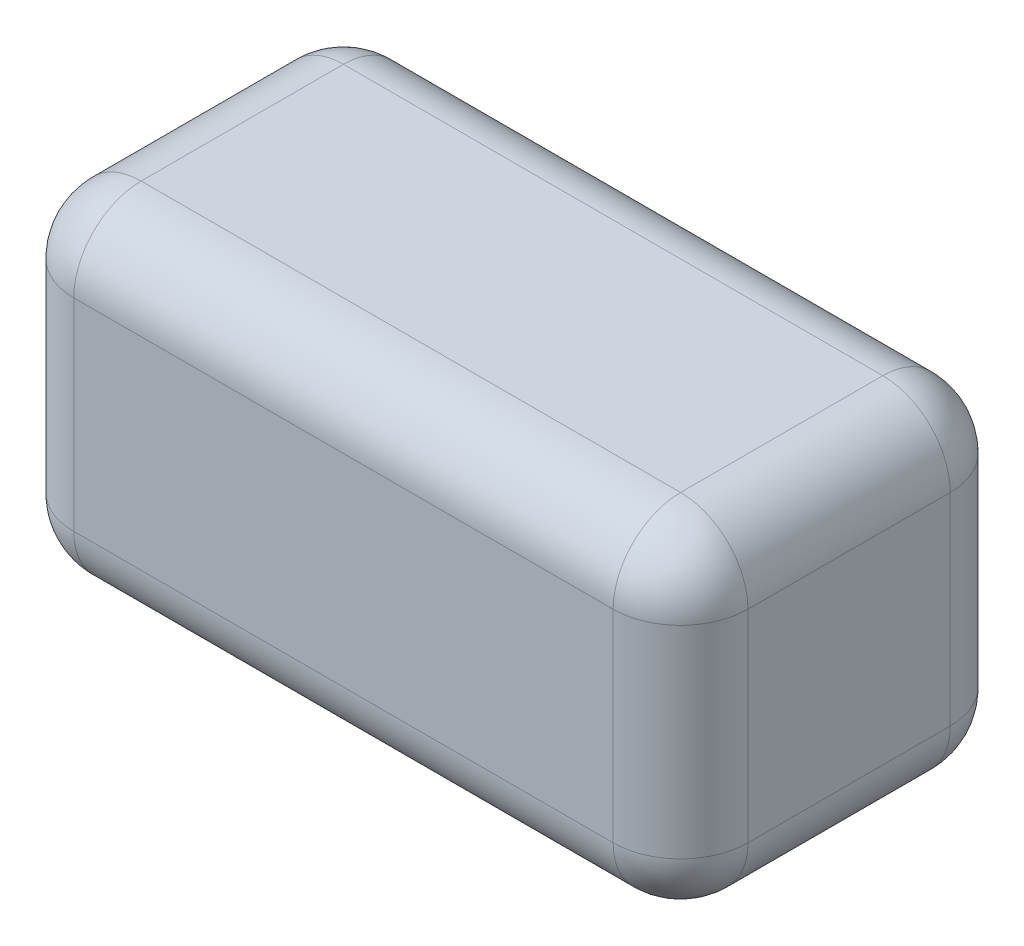
ISO-10303-21;
HEADER;
FILE_DESCRIPTION(('STEP AP214'),'2;1');
FILE_NAME('part.step','',(''),(''),'','','');
FILE_SCHEMA(('AUTOMOTIVE_DESIGN { 1 0 10303 214 1 1 1 1 }'));
ENDSEC;
DATA;
#1=APPLICATION_CONTEXT('core data for automotive mechanical design processes');
#2=APPLICATION_PROTOCOL_DEFINITION('international standard','automotive_design',2000,#1);
#3=PRODUCT_CONTEXT('',#1,'mechanical');
#4=PRODUCT('Part','Part','',(#3));
#5=PRODUCT_RELATED_PRODUCT_CATEGORY('part','',(#4));
#6=PRODUCT_DEFINITION_FORMATION('','',#4);
#7=PRODUCT_DEFINITION_CONTEXT('part definition',#1,'design');
#8=PRODUCT_DEFINITION('design','',#6,#7);
#9=PRODUCT_DEFINITION_SHAPE('','',#8);
#10=(LENGTH_UNIT() NAMED_UNIT(*) SI_UNIT(.MILLI.,.METRE.));
#11=(NAMED_UNIT(*) PLANE_ANGLE_UNIT() SI_UNIT($,.RADIAN.));
#12=(NAMED_UNIT(*) SI_UNIT($,.STERADIAN.) SOLID_ANGLE_UNIT());
#13=UNCERTAINTY_MEASURE_WITH_UNIT(LENGTH_MEASURE(1.E-05),#10,'distance_accuracy_value','');
#14=(GEOMETRIC_REPRESENTATION_CONTEXT(3) GLOBAL_UNCERTAINTY_ASSIGNED_CONTEXT((#13)) GLOBAL_UNIT_ASSIGNED_CONTEXT((#10,
#11,#12)) REPRESENTATION_CONTEXT('',''));
#15=CARTESIAN_POINT('',(0.,0.,0.));
#16=DIRECTION('',(0.,0.,1.));
#17=DIRECTION('',(1.,0.,0.));
#18=AXIS2_PLACEMENT_3D('',#15,#16,#17);
#19=CARTESIAN_POINT('',(-50.,50.,-25.));
#20=DIRECTION('',(1.,0.,0.));
#21=DIRECTION('',(0.,0.,-1.));
#22=AXIS2_PLACEMENT_3D('',#19,#20,#21);
#23=PLANE('',#22);
#24=DIRECTION('',(0.,0.,1.));
#25=VECTOR('',#24,1.);
#26=CARTESIAN_POINT('',(-50.,40.,-25.));
#27=LINE('',#26,#25);
#28=CARTESIAN_POINT('',(-50.,40.,15.));
#29=VERTEX_POINT('',#28);
#30=CARTESIAN_POINT('',(-50.,40.,-15.));
#31=VERTEX_POINT('',#30);
#32=EDGE_CURVE('E203',#29,#31,#27,.F.);
#33=ORIENTED_EDGE('',*,*,#32,.T.);
#34=DIRECTION('',(0.,-1.,0.));
#35=VECTOR('',#34,1.);
#36=CARTESIAN_POINT('',(-50.,50.,-15.));
#37=LINE('',#36,#35);
#38=CARTESIAN_POINT('',(-50.,10.,-15.));
#39=VERTEX_POINT('',#38);
#40=EDGE_CURVE('E276',#31,#39,#37,.T.);
#41=ORIENTED_EDGE('',*,*,#40,.T.);
#42=DIRECTION('',(0.,0.,1.));
#43=VECTOR('',#42,1.);
#44=CARTESIAN_POINT('',(-50.,10.,15.));
#45=LINE('',#44,#43);
#46=CARTESIAN_POINT('',(-50.,10.,15.));
#47=VERTEX_POINT('',#46);
#48=EDGE_CURVE('E273',#39,#47,#45,.T.);
#49=ORIENTED_EDGE('',*,*,#48,.T.);
#50=DIRECTION('',(0.,-1.,0.));
#51=VECTOR('',#50,1.);
#52=CARTESIAN_POINT('',(-50.,50.,15.));
#53=LINE('',#52,#51);
#54=EDGE_CURVE('E200',#47,#29,#53,.F.);
#55=ORIENTED_EDGE('',*,*,#54,.T.);
#56=EDGE_LOOP('',(#33,#41,#49,#55));
#57=FACE_BOUND('',#56,.T.);
#58=ADVANCED_FACE('F40',(#57),#23,.F.);
#59=CARTESIAN_POINT('',(50.,50.,25.));
#60=DIRECTION('',(0.,0.,-1.));
#61=DIRECTION('',(-1.,0.,0.));
#62=AXIS2_PLACEMENT_3D('',#59,#60,#61);
#63=PLANE('',#62);
#64=DIRECTION('',(1.,0.,0.));
#65=VECTOR('',#64,1.);
#66=CARTESIAN_POINT('',(50.,40.,25.));
#67=LINE('',#66,#65);
#68=CARTESIAN_POINT('',(40.,40.,25.));
#69=VERTEX_POINT('',#68);
#70=CARTESIAN_POINT('',(-40.,40.,25.));
#71=VERTEX_POINT('',#70);
#72=EDGE_CURVE('E213',#69,#71,#67,.F.);
#73=ORIENTED_EDGE('',*,*,#72,.T.);
#74=DIRECTION('',(0.,-1.,0.));
#75=VECTOR('',#74,1.);
#76=CARTESIAN_POINT('',(-40.,50.,25.));
#77=LINE('',#76,#75);
#78=CARTESIAN_POINT('',(-40.,10.,25.));
#79=VERTEX_POINT('',#78);
#80=EDGE_CURVE('E216',#71,#79,#77,.T.);
#81=ORIENTED_EDGE('',*,*,#80,.T.);
#82=DIRECTION('',(1.,0.,0.));
#83=VECTOR('',#82,1.);
#84=CARTESIAN_POINT('',(50.,10.,25.));
#85=LINE('',#84,#83);
#86=CARTESIAN_POINT('',(40.,10.,25.));
#87=VERTEX_POINT('',#86);
#88=EDGE_CURVE('E207',#79,#87,#85,.T.);
#89=ORIENTED_EDGE('',*,*,#88,.T.);
#90=DIRECTION('',(0.,-1.,0.));
#91=VECTOR('',#90,1.);
#92=CARTESIAN_POINT('',(40.,50.,25.));
#93=LINE('',#92,#91);
#94=EDGE_CURVE('E210',#87,#69,#93,.F.);
#95=ORIENTED_EDGE('',*,*,#94,.T.);
#96=EDGE_LOOP('',(#73,#81,#89,#95));
#97=FACE_BOUND('',#96,.T.);
#98=ADVANCED_FACE('F371',(#97),#63,.F.);
#99=CARTESIAN_POINT('',(50.,50.,-25.));
#100=DIRECTION('',(-1.,0.,0.));
#101=DIRECTION('',(0.,0.,1.));
#102=AXIS2_PLACEMENT_3D('',#99,#100,#101);
#103=PLANE('',#102);
#104=DIRECTION('',(0.,0.,-1.));
#105=VECTOR('',#104,1.);
#106=CARTESIAN_POINT('',(50.,10.,-25.));
#107=LINE('',#106,#105);
#108=CARTESIAN_POINT('',(50.,10.,15.));
#109=VERTEX_POINT('',#108);
#110=CARTESIAN_POINT('',(50.,10.,-15.));
#111=VERTEX_POINT('',#110);
#112=EDGE_CURVE('E175',#109,#111,#107,.T.);
#113=ORIENTED_EDGE('',*,*,#112,.T.);
#114=DIRECTION('',(0.,-1.,0.));
#115=VECTOR('',#114,1.);
#116=CARTESIAN_POINT('',(50.,50.,-15.));
#117=LINE('',#116,#115);
#118=CARTESIAN_POINT('',(50.,40.,-15.));
#119=VERTEX_POINT('',#118);
#120=EDGE_CURVE('E179',#111,#119,#117,.F.);
#121=ORIENTED_EDGE('',*,*,#120,.T.);
#122=DIRECTION('',(0.,0.,-1.));
#123=VECTOR('',#122,1.);
#124=CARTESIAN_POINT('',(50.,40.,-25.));
#125=LINE('',#124,#123);
#126=CARTESIAN_POINT('',(50.,40.,15.));
#127=VERTEX_POINT('',#126);
#128=EDGE_CURVE('E170',#119,#127,#125,.F.);
#129=ORIENTED_EDGE('',*,*,#128,.T.);
#130=DIRECTION('',(0.,-1.,0.));
#131=VECTOR('',#130,1.);
#132=CARTESIAN_POINT('',(50.,50.,15.));
#133=LINE('',#132,#131);
#134=EDGE_CURVE('E167',#127,#109,#133,.T.);
#135=ORIENTED_EDGE('',*,*,#134,.T.);
#136=EDGE_LOOP('',(#113,#121,#129,#135));
#137=FACE_BOUND('',#136,.T.);
#138=ADVANCED_FACE('F329',(#137),#103,.F.);
#139=CARTESIAN_POINT('',(50.,50.,-25.));
#140=DIRECTION('',(0.,0.,1.));
#141=DIRECTION('',(1.,0.,0.));
#142=AXIS2_PLACEMENT_3D('',#139,#140,#141);
#143=PLANE('',#142);
#144=DIRECTION('',(-1.,0.,0.));
#145=VECTOR('',#144,1.);
#146=CARTESIAN_POINT('',(-50.,10.,-25.));
#147=LINE('',#146,#145);
#148=CARTESIAN_POINT('',(40.,10.,-25.));
#149=VERTEX_POINT('',#148);
#150=CARTESIAN_POINT('',(-40.,10.,-25.));
#151=VERTEX_POINT('',#150);
#152=EDGE_CURVE('E64',#149,#151,#147,.T.);
#153=ORIENTED_EDGE('',*,*,#152,.T.);
#154=DIRECTION('',(0.,-1.,0.));
#155=VECTOR('',#154,1.);
#156=CARTESIAN_POINT('',(-40.,50.,-25.));
#157=LINE('',#156,#155);
#158=CARTESIAN_POINT('',(-40.,40.,-25.));
#159=VERTEX_POINT('',#158);
#160=EDGE_CURVE('E135',#151,#159,#157,.F.);
#161=ORIENTED_EDGE('',*,*,#160,.T.);
#162=DIRECTION('',(-1.,0.,0.));
#163=VECTOR('',#162,1.);
#164=CARTESIAN_POINT('',(50.,40.,-25.));
#165=LINE('',#164,#163);
#166=CARTESIAN_POINT('',(40.,40.,-25.));
#167=VERTEX_POINT('',#166);
#168=EDGE_CURVE('E130',#159,#167,#165,.F.);
#169=ORIENTED_EDGE('',*,*,#168,.T.);
#170=DIRECTION('',(0.,-1.,0.));
#171=VECTOR('',#170,1.);
#172=CARTESIAN_POINT('',(40.,50.,-25.));
#173=LINE('',#172,#171);
#174=EDGE_CURVE('E134',#167,#149,#173,.T.);
#175=ORIENTED_EDGE('',*,*,#174,.T.);
#176=EDGE_LOOP('',(#153,#161,#169,#175));
#177=FACE_BOUND('',#176,.T.);
#178=ADVANCED_FACE('F132',(#177),#143,.F.);
#179=CARTESIAN_POINT('',(0.,50.,0.));
#180=DIRECTION('',(0.,-1.,0.));
#181=DIRECTION('',(0.,0.,-1.));
#182=AXIS2_PLACEMENT_3D('',#179,#180,#181);
#183=PLANE('',#182);
#184=DIRECTION('',(0.,0.,-1.));
#185=VECTOR('',#184,1.);
#186=CARTESIAN_POINT('',(40.,50.,0.));
#187=LINE('',#186,#185);
#188=CARTESIAN_POINT('',(40.,50.,15.));
#189=VERTEX_POINT('',#188);
#190=CARTESIAN_POINT('',(40.,50.,-15.));
#191=VERTEX_POINT('',#190);
#192=EDGE_CURVE('E195',#189,#191,#187,.T.);
#193=ORIENTED_EDGE('',*,*,#192,.T.);
#194=DIRECTION('',(-1.,0.,0.));
#195=VECTOR('',#194,1.);
#196=CARTESIAN_POINT('',(0.,50.,-15.));
#197=LINE('',#196,#195);
#198=CARTESIAN_POINT('',(-40.,50.,-15.));
#199=VERTEX_POINT('',#198);
#200=EDGE_CURVE('E147',#191,#199,#197,.T.);
#201=ORIENTED_EDGE('',*,*,#200,.T.);
#202=DIRECTION('',(0.,0.,1.));
#203=VECTOR('',#202,1.);
#204=CARTESIAN_POINT('',(-40.,50.,0.));
#205=LINE('',#204,#203);
#206=CARTESIAN_POINT('',(-40.,50.,15.));
#207=VERTEX_POINT('',#206);
#208=EDGE_CURVE('E192',#199,#207,#205,.T.);
#209=ORIENTED_EDGE('',*,*,#208,.T.);
#210=DIRECTION('',(1.,0.,0.));
#211=VECTOR('',#210,1.);
#212=CARTESIAN_POINT('',(0.,50.,15.));
#213=LINE('',#212,#211);
#214=EDGE_CURVE('E189',#207,#189,#213,.T.);
#215=ORIENTED_EDGE('',*,*,#214,.T.);
#216=EDGE_LOOP('',(#193,#201,#209,#215));
#217=FACE_BOUND('',#216,.T.);
#218=ADVANCED_FACE('F321',(#217),#183,.F.);
#219=CARTESIAN_POINT('',(0.,0.,0.));
#220=DIRECTION('',(0.,-1.,0.));
#221=DIRECTION('',(0.,0.,-1.));
#222=AXIS2_PLACEMENT_3D('',#219,#220,#221);
#223=PLANE('',#222);
#224=DIRECTION('',(1.,0.,0.));
#225=VECTOR('',#224,1.);
#226=CARTESIAN_POINT('',(-50.,0.,15.));
#227=LINE('',#226,#225);
#228=CARTESIAN_POINT('',(40.,0.,15.));
#229=VERTEX_POINT('',#228);
#230=CARTESIAN_POINT('',(-40.,0.,15.));
#231=VERTEX_POINT('',#230);
#232=EDGE_CURVE('E183',#229,#231,#227,.F.);
#233=ORIENTED_EDGE('',*,*,#232,.T.);
#234=DIRECTION('',(0.,0.,1.));
#235=VECTOR('',#234,1.);
#236=CARTESIAN_POINT('',(-40.,0.,-25.));
#237=LINE('',#236,#235);
#238=CARTESIAN_POINT('',(-40.,0.,-15.));
#239=VERTEX_POINT('',#238);
#240=EDGE_CURVE('E11',#231,#239,#237,.F.);
#241=ORIENTED_EDGE('',*,*,#240,.T.);
#242=DIRECTION('',(-1.,0.,0.));
#243=VECTOR('',#242,1.);
#244=CARTESIAN_POINT('',(40.,0.,-15.));
#245=LINE('',#244,#243);
#246=CARTESIAN_POINT('',(40.,0.,-15.));
#247=VERTEX_POINT('',#246);
#248=EDGE_CURVE('E50',#239,#247,#245,.F.);
#249=ORIENTED_EDGE('',*,*,#248,.T.);
#250=DIRECTION('',(0.,0.,-1.));
#251=VECTOR('',#250,1.);
#252=CARTESIAN_POINT('',(40.,0.,25.));
#253=LINE('',#252,#251);
#254=EDGE_CURVE('E186',#247,#229,#253,.F.);
#255=ORIENTED_EDGE('',*,*,#254,.T.);
#256=EDGE_LOOP('',(#233,#241,#249,#255));
#257=FACE_BOUND('',#256,.T.);
#258=ADVANCED_FACE('F357',(#257),#223,.T.);
#259=CARTESIAN_POINT('',(0.,40.,15.));
#260=DIRECTION('',(1.,0.,0.));
#261=DIRECTION('',(0.,0.,-1.));
#262=AXIS2_PLACEMENT_3D('',#259,#260,#261);
#263=CYLINDRICAL_SURFACE('',#262,10.);
#264=CARTESIAN_POINT('',(-40.,40.,15.));
#265=DIRECTION('',(-1.,0.,0.));
#266=DIRECTION('',(0.,0.,1.));
#267=AXIS2_PLACEMENT_3D('',#264,#265,#266);
#268=CIRCLE('',#267,10.);
#269=EDGE_CURVE('E139',#71,#207,#268,.T.);
#270=ORIENTED_EDGE('',*,*,#269,.F.);
#271=ORIENTED_EDGE('',*,*,#72,.F.);
#272=CARTESIAN_POINT('',(40.,40.,15.));
#273=DIRECTION('',(1.,0.,0.));
#274=DIRECTION('',(0.,0.,-1.));
#275=AXIS2_PLACEMENT_3D('',#272,#273,#274);
#276=CIRCLE('',#275,10.);
#277=EDGE_CURVE('E245',#189,#69,#276,.T.);
#278=ORIENTED_EDGE('',*,*,#277,.F.);
#279=ORIENTED_EDGE('',*,*,#214,.F.);
#280=EDGE_LOOP('',(#270,#271,#278,#279));
#281=FACE_BOUND('',#280,.T.);
#282=ADVANCED_FACE('F374',(#281),#263,.T.);
#283=CARTESIAN_POINT('',(-40.,40.,15.));
#284=DIRECTION('',(0.,0.,1.));
#285=DIRECTION('',(1.,0.,0.));
#286=AXIS2_PLACEMENT_3D('',#283,#284,#285);
#287=SPHERICAL_SURFACE('',#286,10.);
#288=CARTESIAN_POINT('',(-40.,40.,15.));
#289=DIRECTION('',(0.,0.,1.));
#290=DIRECTION('',(1.,0.,0.));
#291=AXIS2_PLACEMENT_3D('',#288,#289,#290);
#292=CIRCLE('',#291,10.);
#293=EDGE_CURVE('E241',#29,#207,#292,.F.);
#294=ORIENTED_EDGE('',*,*,#293,.F.);
#295=CARTESIAN_POINT('',(-40.,40.,15.));
#296=DIRECTION('',(0.,1.,0.));
#297=DIRECTION('',(0.,0.,1.));
#298=AXIS2_PLACEMENT_3D('',#295,#296,#297);
#299=CIRCLE('',#298,10.);
#300=EDGE_CURVE('E249',#71,#29,#299,.F.);
#301=ORIENTED_EDGE('',*,*,#300,.F.);
#302=ORIENTED_EDGE('',*,*,#269,.T.);
#303=EDGE_LOOP('',(#294,#301,#302));
#304=FACE_BOUND('',#303,.T.);
#305=ADVANCED_FACE('F384',(#304),#287,.T.);
#306=CARTESIAN_POINT('',(-40.,50.,15.));
#307=DIRECTION('',(0.,-1.,0.));
#308=DIRECTION('',(0.,0.,-1.));
#309=AXIS2_PLACEMENT_3D('',#306,#307,#308);
#310=CYLINDRICAL_SURFACE('',#309,10.);
#311=ORIENTED_EDGE('',*,*,#54,.F.);
#312=CARTESIAN_POINT('',(-40.,10.,15.));
#313=DIRECTION('',(0.,-1.,0.));
#314=DIRECTION('',(0.,0.,-1.));
#315=AXIS2_PLACEMENT_3D('',#312,#313,#314);
#316=CIRCLE('',#315,10.);
#317=EDGE_CURVE('E264',#47,#79,#316,.F.);
#318=ORIENTED_EDGE('',*,*,#317,.T.);
#319=ORIENTED_EDGE('',*,*,#80,.F.);
#320=ORIENTED_EDGE('',*,*,#300,.T.);
#321=EDGE_LOOP('',(#311,#318,#319,#320));
#322=FACE_BOUND('',#321,.T.);
#323=ADVANCED_FACE('F346',(#322),#310,.T.);
#324=CARTESIAN_POINT('',(40.,40.,15.));
#325=DIRECTION('',(0.,0.,1.));
#326=DIRECTION('',(1.,0.,0.));
#327=AXIS2_PLACEMENT_3D('',#324,#325,#326);
#328=SPHERICAL_SURFACE('',#327,10.);
#329=CARTESIAN_POINT('',(40.,40.,15.));
#330=DIRECTION('',(0.,0.,1.));
#331=DIRECTION('',(0.,-1.,0.));
#332=AXIS2_PLACEMENT_3D('',#329,#330,#331);
#333=CIRCLE('',#332,10.);
#334=EDGE_CURVE('E233',#189,#127,#333,.F.);
#335=ORIENTED_EDGE('',*,*,#334,.F.);
#336=ORIENTED_EDGE('',*,*,#277,.T.);
#337=CARTESIAN_POINT('',(40.,40.,15.));
#338=DIRECTION('',(0.,1.,0.));
#339=DIRECTION('',(0.,0.,1.));
#340=AXIS2_PLACEMENT_3D('',#337,#338,#339);
#341=CIRCLE('',#340,10.);
#342=EDGE_CURVE('E237',#127,#69,#341,.F.);
#343=ORIENTED_EDGE('',*,*,#342,.F.);
#344=EDGE_LOOP('',(#335,#336,#343));
#345=FACE_BOUND('',#344,.T.);
#346=ADVANCED_FACE('F376',(#345),#328,.T.);
#347=CARTESIAN_POINT('',(-40.,40.,0.));
#348=DIRECTION('',(0.,0.,1.));
#349=DIRECTION('',(1.,0.,0.));
#350=AXIS2_PLACEMENT_3D('',#347,#348,#349);
#351=CYLINDRICAL_SURFACE('',#350,10.);
#352=ORIENTED_EDGE('',*,*,#208,.F.);
#353=CARTESIAN_POINT('',(-40.,40.,-15.));
#354=DIRECTION('',(0.,0.,1.));
#355=DIRECTION('',(1.,0.,0.));
#356=AXIS2_PLACEMENT_3D('',#353,#354,#355);
#357=CIRCLE('',#356,10.);
#358=EDGE_CURVE('E270',#199,#31,#357,.T.);
#359=ORIENTED_EDGE('',*,*,#358,.T.);
#360=ORIENTED_EDGE('',*,*,#32,.F.);
#361=ORIENTED_EDGE('',*,*,#293,.T.);
#362=EDGE_LOOP('',(#352,#359,#360,#361));
#363=FACE_BOUND('',#362,.T.);
#364=ADVANCED_FACE('F316',(#363),#351,.T.);
#365=CARTESIAN_POINT('',(50.,10.,15.));
#366=DIRECTION('',(-1.,0.,0.));
#367=DIRECTION('',(0.,0.,1.));
#368=AXIS2_PLACEMENT_3D('',#365,#366,#367);
#369=CYLINDRICAL_SURFACE('',#368,10.);
#370=ORIENTED_EDGE('',*,*,#88,.F.);
#371=CARTESIAN_POINT('',(-40.,10.,15.));
#372=DIRECTION('',(-1.,0.,0.));
#373=DIRECTION('',(0.,0.,1.));
#374=AXIS2_PLACEMENT_3D('',#371,#372,#373);
#375=CIRCLE('',#374,10.);
#376=EDGE_CURVE('E261',#79,#231,#375,.F.);
#377=ORIENTED_EDGE('',*,*,#376,.T.);
#378=ORIENTED_EDGE('',*,*,#232,.F.);
#379=CARTESIAN_POINT('',(40.,10.,15.));
#380=DIRECTION('',(1.,0.,0.));
#381=DIRECTION('',(0.,0.,-1.));
#382=AXIS2_PLACEMENT_3D('',#379,#380,#381);
#383=CIRCLE('',#382,10.);
#384=EDGE_CURVE('E229',#87,#229,#383,.T.);
#385=ORIENTED_EDGE('',*,*,#384,.F.);
#386=EDGE_LOOP('',(#370,#377,#378,#385));
#387=FACE_BOUND('',#386,.T.);
#388=ADVANCED_FACE('F355',(#387),#369,.T.);
#389=CARTESIAN_POINT('',(40.,50.,15.));
#390=DIRECTION('',(0.,-1.,0.));
#391=DIRECTION('',(0.,0.,-1.));
#392=AXIS2_PLACEMENT_3D('',#389,#390,#391);
#393=CYLINDRICAL_SURFACE('',#392,10.);
#394=ORIENTED_EDGE('',*,*,#342,.T.);
#395=ORIENTED_EDGE('',*,*,#94,.F.);
#396=CARTESIAN_POINT('',(40.,10.,15.));
#397=DIRECTION('',(0.,-1.,0.));
#398=DIRECTION('',(0.,0.,-1.));
#399=AXIS2_PLACEMENT_3D('',#396,#397,#398);
#400=CIRCLE('',#399,10.);
#401=EDGE_CURVE('E225',#109,#87,#400,.T.);
#402=ORIENTED_EDGE('',*,*,#401,.F.);
#403=ORIENTED_EDGE('',*,*,#134,.F.);
#404=EDGE_LOOP('',(#394,#395,#402,#403));
#405=FACE_BOUND('',#404,.T.);
#406=ADVANCED_FACE('F368',(#405),#393,.T.);
#407=CARTESIAN_POINT('',(40.,40.,0.));
#408=DIRECTION('',(0.,0.,-1.));
#409=DIRECTION('',(-1.,0.,0.));
#410=AXIS2_PLACEMENT_3D('',#407,#408,#409);
#411=CYLINDRICAL_SURFACE('',#410,10.);
#412=ORIENTED_EDGE('',*,*,#334,.T.);
#413=ORIENTED_EDGE('',*,*,#128,.F.);
#414=CARTESIAN_POINT('',(40.,40.,-15.));
#415=DIRECTION('',(0.,0.,-1.));
#416=DIRECTION('',(-1.,0.,0.));
#417=AXIS2_PLACEMENT_3D('',#414,#415,#416);
#418=CIRCLE('',#417,10.);
#419=EDGE_CURVE('E152',#191,#119,#418,.T.);
#420=ORIENTED_EDGE('',*,*,#419,.F.);
#421=ORIENTED_EDGE('',*,*,#192,.F.);
#422=EDGE_LOOP('',(#412,#413,#420,#421));
#423=FACE_BOUND('',#422,.T.);
#424=ADVANCED_FACE('F325',(#423),#411,.T.);
#425=CARTESIAN_POINT('',(0.,40.,-15.));
#426=DIRECTION('',(-1.,0.,0.));
#427=DIRECTION('',(0.,0.,1.));
#428=AXIS2_PLACEMENT_3D('',#425,#426,#427);
#429=CYLINDRICAL_SURFACE('',#428,10.);
#430=ORIENTED_EDGE('',*,*,#168,.F.);
#431=CARTESIAN_POINT('',(-40.,40.,-15.));
#432=DIRECTION('',(-1.,0.,0.));
#433=DIRECTION('',(0.,0.,1.));
#434=AXIS2_PLACEMENT_3D('',#431,#432,#433);
#435=CIRCLE('',#434,10.);
#436=EDGE_CURVE('E267',#159,#199,#435,.F.);
#437=ORIENTED_EDGE('',*,*,#436,.T.);
#438=ORIENTED_EDGE('',*,*,#200,.F.);
#439=CARTESIAN_POINT('',(40.,40.,-15.));
#440=DIRECTION('',(1.,0.,0.));
#441=DIRECTION('',(0.,0.,-1.));
#442=AXIS2_PLACEMENT_3D('',#439,#440,#441);
#443=CIRCLE('',#442,10.);
#444=EDGE_CURVE('E143',#167,#191,#443,.T.);
#445=ORIENTED_EDGE('',*,*,#444,.F.);
#446=EDGE_LOOP('',(#430,#437,#438,#445));
#447=FACE_BOUND('',#446,.T.);
#448=ADVANCED_FACE('F145',(#447),#429,.T.);
#449=CARTESIAN_POINT('',(40.,10.,15.));
#450=DIRECTION('',(0.,0.,1.));
#451=DIRECTION('',(0.,-1.,0.));
#452=AXIS2_PLACEMENT_3D('',#449,#450,#451);
#453=SPHERICAL_SURFACE('',#452,10.);
#454=ORIENTED_EDGE('',*,*,#401,.T.);
#455=ORIENTED_EDGE('',*,*,#384,.T.);
#456=CARTESIAN_POINT('',(40.,10.,15.));
#457=DIRECTION('',(0.,0.,1.));
#458=DIRECTION('',(1.,0.,0.));
#459=AXIS2_PLACEMENT_3D('',#456,#457,#458);
#460=CIRCLE('',#459,10.);
#461=EDGE_CURVE('E153',#109,#229,#460,.F.);
#462=ORIENTED_EDGE('',*,*,#461,.F.);
#463=EDGE_LOOP('',(#454,#455,#462));
#464=FACE_BOUND('',#463,.T.);
#465=ADVANCED_FACE('F363',(#464),#453,.T.);
#466=CARTESIAN_POINT('',(40.,40.,-15.));
#467=DIRECTION('',(0.,1.,0.));
#468=DIRECTION('',(0.,0.,1.));
#469=AXIS2_PLACEMENT_3D('',#466,#467,#468);
#470=SPHERICAL_SURFACE('',#469,10.);
#471=ORIENTED_EDGE('',*,*,#444,.T.);
#472=ORIENTED_EDGE('',*,*,#419,.T.);
#473=CARTESIAN_POINT('',(40.,40.,-15.));
#474=DIRECTION('',(0.,1.,0.));
#475=DIRECTION('',(0.,0.,1.));
#476=AXIS2_PLACEMENT_3D('',#473,#474,#475);
#477=CIRCLE('',#476,10.);
#478=EDGE_CURVE('E155',#167,#119,#477,.F.);
#479=ORIENTED_EDGE('',*,*,#478,.F.);
#480=EDGE_LOOP('',(#471,#472,#479));
#481=FACE_BOUND('',#480,.T.);
#482=ADVANCED_FACE('F156',(#481),#470,.T.);
#483=CARTESIAN_POINT('',(40.,10.,-25.));
#484=DIRECTION('',(0.,0.,1.));
#485=DIRECTION('',(1.,0.,0.));
#486=AXIS2_PLACEMENT_3D('',#483,#484,#485);
#487=CYLINDRICAL_SURFACE('',#486,10.);
#488=ORIENTED_EDGE('',*,*,#254,.F.);
#489=CARTESIAN_POINT('',(40.,10.,-15.));
#490=DIRECTION('',(0.,0.,1.));
#491=DIRECTION('',(1.,0.,0.));
#492=AXIS2_PLACEMENT_3D('',#489,#490,#491);
#493=CIRCLE('',#492,10.);
#494=EDGE_CURVE('E258',#247,#111,#493,.T.);
#495=ORIENTED_EDGE('',*,*,#494,.T.);
#496=ORIENTED_EDGE('',*,*,#112,.F.);
#497=ORIENTED_EDGE('',*,*,#461,.T.);
#498=EDGE_LOOP('',(#488,#495,#496,#497));
#499=FACE_BOUND('',#498,.T.);
#500=ADVANCED_FACE('F360',(#499),#487,.T.);
#501=CARTESIAN_POINT('',(40.,50.,-15.));
#502=DIRECTION('',(0.,-1.,0.));
#503=DIRECTION('',(0.,0.,-1.));
#504=AXIS2_PLACEMENT_3D('',#501,#502,#503);
#505=CYLINDRICAL_SURFACE('',#504,10.);
#506=ORIENTED_EDGE('',*,*,#120,.F.);
#507=CARTESIAN_POINT('',(40.,10.,-15.));
#508=DIRECTION('',(0.,-1.,0.));
#509=DIRECTION('',(0.,0.,-1.));
#510=AXIS2_PLACEMENT_3D('',#507,#508,#509);
#511=CIRCLE('',#510,10.);
#512=EDGE_CURVE('E165',#111,#149,#511,.F.);
#513=ORIENTED_EDGE('',*,*,#512,.T.);
#514=ORIENTED_EDGE('',*,*,#174,.F.);
#515=ORIENTED_EDGE('',*,*,#478,.T.);
#516=EDGE_LOOP('',(#506,#513,#514,#515));
#517=FACE_BOUND('',#516,.T.);
#518=ADVANCED_FACE('F163',(#517),#505,.T.);
#519=CARTESIAN_POINT('',(-40.,40.,-15.));
#520=DIRECTION('',(0.,0.,1.));
#521=DIRECTION('',(1.,0.,0.));
#522=AXIS2_PLACEMENT_3D('',#519,#520,#521);
#523=SPHERICAL_SURFACE('',#522,10.);
#524=ORIENTED_EDGE('',*,*,#358,.F.);
#525=ORIENTED_EDGE('',*,*,#436,.F.);
#526=CARTESIAN_POINT('',(-40.,40.,-15.));
#527=DIRECTION('',(0.,-1.,0.));
#528=DIRECTION('',(0.,0.,-1.));
#529=AXIS2_PLACEMENT_3D('',#526,#527,#528);
#530=CIRCLE('',#529,10.);
#531=EDGE_CURVE('E44',#31,#159,#530,.T.);
#532=ORIENTED_EDGE('',*,*,#531,.F.);
#533=EDGE_LOOP('',(#524,#525,#532));
#534=FACE_BOUND('',#533,.T.);
#535=ADVANCED_FACE('F42',(#534),#523,.T.);
#536=CARTESIAN_POINT('',(-40.,10.,15.));
#537=DIRECTION('',(0.,0.,1.));
#538=DIRECTION('',(1.,0.,0.));
#539=AXIS2_PLACEMENT_3D('',#536,#537,#538);
#540=SPHERICAL_SURFACE('',#539,10.);
#541=ORIENTED_EDGE('',*,*,#376,.F.);
#542=ORIENTED_EDGE('',*,*,#317,.F.);
#543=CARTESIAN_POINT('',(-40.,10.,15.));
#544=DIRECTION('',(0.,0.,-1.));
#545=DIRECTION('',(-1.,0.,0.));
#546=AXIS2_PLACEMENT_3D('',#543,#544,#545);
#547=CIRCLE('',#546,10.);
#548=EDGE_CURVE('E299',#231,#47,#547,.T.);
#549=ORIENTED_EDGE('',*,*,#548,.F.);
#550=EDGE_LOOP('',(#541,#542,#549));
#551=FACE_BOUND('',#550,.T.);
#552=ADVANCED_FACE('F352',(#551),#540,.T.);
#553=CARTESIAN_POINT('',(-40.,50.,-15.));
#554=DIRECTION('',(0.,-1.,0.));
#555=DIRECTION('',(0.,0.,-1.));
#556=AXIS2_PLACEMENT_3D('',#553,#554,#555);
#557=CYLINDRICAL_SURFACE('',#556,10.);
#558=ORIENTED_EDGE('',*,*,#531,.T.);
#559=ORIENTED_EDGE('',*,*,#160,.F.);
#560=CARTESIAN_POINT('',(-40.,10.,-15.));
#561=DIRECTION('',(0.,-1.,0.));
#562=DIRECTION('',(0.,0.,-1.));
#563=AXIS2_PLACEMENT_3D('',#560,#561,#562);
#564=CIRCLE('',#563,10.);
#565=EDGE_CURVE('E296',#39,#151,#564,.T.);
#566=ORIENTED_EDGE('',*,*,#565,.F.);
#567=ORIENTED_EDGE('',*,*,#40,.F.);
#568=EDGE_LOOP('',(#558,#559,#566,#567));
#569=FACE_BOUND('',#568,.T.);
#570=ADVANCED_FACE('F310',(#569),#557,.T.);
#571=CARTESIAN_POINT('',(-40.,10.,-25.));
#572=DIRECTION('',(0.,0.,-1.));
#573=DIRECTION('',(-1.,0.,0.));
#574=AXIS2_PLACEMENT_3D('',#571,#572,#573);
#575=CYLINDRICAL_SURFACE('',#574,10.);
#576=ORIENTED_EDGE('',*,*,#548,.T.);
#577=ORIENTED_EDGE('',*,*,#48,.F.);
#578=CARTESIAN_POINT('',(-40.,10.,-15.));
#579=DIRECTION('',(0.,0.,-1.));
#580=DIRECTION('',(-1.,0.,0.));
#581=AXIS2_PLACEMENT_3D('',#578,#579,#580);
#582=CIRCLE('',#581,10.);
#583=EDGE_CURVE('E292',#239,#39,#582,.T.);
#584=ORIENTED_EDGE('',*,*,#583,.F.);
#585=ORIENTED_EDGE('',*,*,#240,.F.);
#586=EDGE_LOOP('',(#576,#577,#584,#585));
#587=FACE_BOUND('',#586,.T.);
#588=ADVANCED_FACE('F341',(#587),#575,.T.);
#589=CARTESIAN_POINT('',(-40.,10.,-15.));
#590=DIRECTION('',(-1.,0.,0.));
#591=DIRECTION('',(0.,-1.,0.));
#592=AXIS2_PLACEMENT_3D('',#589,#590,#591);
#593=SPHERICAL_SURFACE('',#592,10.);
#594=ORIENTED_EDGE('',*,*,#583,.T.);
#595=ORIENTED_EDGE('',*,*,#565,.T.);
#596=CARTESIAN_POINT('',(-40.,10.,-15.));
#597=DIRECTION('',(-1.,0.,0.));
#598=DIRECTION('',(0.,0.,1.));
#599=AXIS2_PLACEMENT_3D('',#596,#597,#598);
#600=CIRCLE('',#599,10.);
#601=EDGE_CURVE('E288',#239,#151,#600,.F.);
#602=ORIENTED_EDGE('',*,*,#601,.F.);
#603=EDGE_LOOP('',(#594,#595,#602));
#604=FACE_BOUND('',#603,.T.);
#605=ADVANCED_FACE('F340',(#604),#593,.T.);
#606=CARTESIAN_POINT('',(50.,10.,-15.));
#607=DIRECTION('',(1.,0.,0.));
#608=DIRECTION('',(0.,0.,-1.));
#609=AXIS2_PLACEMENT_3D('',#606,#607,#608);
#610=CYLINDRICAL_SURFACE('',#609,10.);
#611=ORIENTED_EDGE('',*,*,#601,.T.);
#612=ORIENTED_EDGE('',*,*,#152,.F.);
#613=CARTESIAN_POINT('',(40.,10.,-15.));
#614=DIRECTION('',(1.,0.,0.));
#615=DIRECTION('',(0.,0.,-1.));
#616=AXIS2_PLACEMENT_3D('',#613,#614,#615);
#617=CIRCLE('',#616,10.);
#618=EDGE_CURVE('E285',#247,#149,#617,.T.);
#619=ORIENTED_EDGE('',*,*,#618,.F.);
#620=ORIENTED_EDGE('',*,*,#248,.F.);
#621=EDGE_LOOP('',(#611,#612,#619,#620));
#622=FACE_BOUND('',#621,.T.);
#623=ADVANCED_FACE('F337',(#622),#610,.T.);
#624=CARTESIAN_POINT('',(40.,10.,-15.));
#625=DIRECTION('',(0.,0.,1.));
#626=DIRECTION('',(1.,0.,0.));
#627=AXIS2_PLACEMENT_3D('',#624,#625,#626);
#628=SPHERICAL_SURFACE('',#627,10.);
#629=ORIENTED_EDGE('',*,*,#512,.F.);
#630=ORIENTED_EDGE('',*,*,#494,.F.);
#631=ORIENTED_EDGE('',*,*,#618,.T.);
#632=EDGE_LOOP('',(#629,#630,#631));
#633=FACE_BOUND('',#632,.T.);
#634=ADVANCED_FACE('F333',(#633),#628,.T.);
#635=CLOSED_SHELL('',(#58,#98,#138,#178,#218,#258,#282,#305,#323,#346,#364,#388,#406,#424,#448,
#465,#482,#500,#518,#535,#552,#570,#588,#605,#623,#634));
#636=MANIFOLD_SOLID_BREP('B2',#635);
#637=ADVANCED_BREP_SHAPE_REPRESENTATION('',(#18,#636),#14);
#638=SHAPE_DEFINITION_REPRESENTATION(#9,#637);
ENDSEC;
END-ISO-10303-21;
